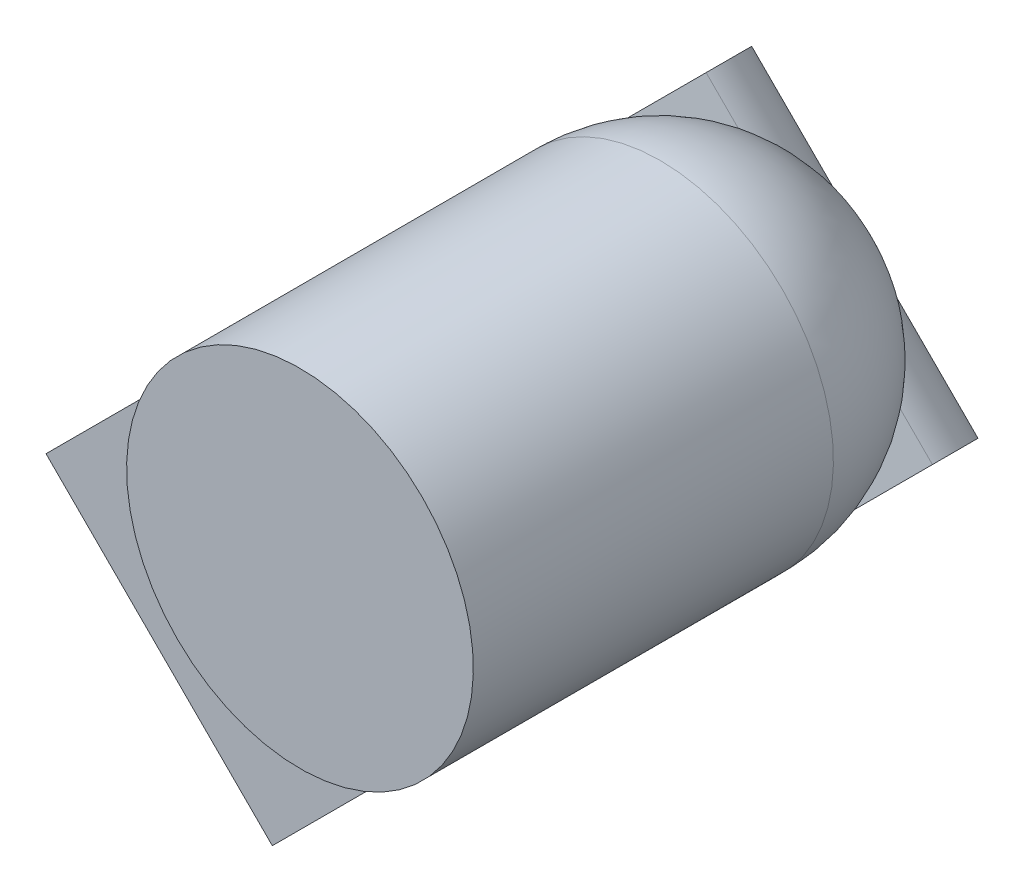
ISO-10303-21;
HEADER;
FILE_DESCRIPTION(('STEP AP214'),'2;1');
FILE_NAME('part.step','',(''),(''),'','','');
FILE_SCHEMA(('AUTOMOTIVE_DESIGN { 1 0 10303 214 1 1 1 1 }'));
ENDSEC;
DATA;
#1=APPLICATION_CONTEXT('core data for automotive mechanical design processes');
#2=APPLICATION_PROTOCOL_DEFINITION('international standard','automotive_design',2000,#1);
#3=PRODUCT_CONTEXT('',#1,'mechanical');
#4=PRODUCT('Part','Part','',(#3));
#5=PRODUCT_RELATED_PRODUCT_CATEGORY('part','',(#4));
#6=PRODUCT_DEFINITION_FORMATION('','',#4);
#7=PRODUCT_DEFINITION_CONTEXT('part definition',#1,'design');
#8=PRODUCT_DEFINITION('design','',#6,#7);
#9=PRODUCT_DEFINITION_SHAPE('','',#8);
#10=(LENGTH_UNIT() NAMED_UNIT(*) SI_UNIT(.MILLI.,.METRE.));
#11=(NAMED_UNIT(*) PLANE_ANGLE_UNIT() SI_UNIT($,.RADIAN.));
#12=(NAMED_UNIT(*) SI_UNIT($,.STERADIAN.) SOLID_ANGLE_UNIT());
#13=UNCERTAINTY_MEASURE_WITH_UNIT(LENGTH_MEASURE(1.E-05),#10,'distance_accuracy_value','');
#14=(GEOMETRIC_REPRESENTATION_CONTEXT(3) GLOBAL_UNCERTAINTY_ASSIGNED_CONTEXT((#13)) GLOBAL_UNIT_ASSIGNED_CONTEXT((#10,
#11,#12)) REPRESENTATION_CONTEXT('',''));
#15=CARTESIAN_POINT('',(0.,0.,0.));
#16=DIRECTION('',(0.,0.,1.));
#17=DIRECTION('',(1.,0.,0.));
#18=AXIS2_PLACEMENT_3D('',#15,#16,#17);
#19=CARTESIAN_POINT('',(-8.48634493812167,-11.9275672571191,4.380316059209));
#20=DIRECTION('',(3.09086344020721E-08,-3.09086344020721E-08,1.));
#21=DIRECTION('',(0.707106781186547,-0.707106781186547,-4.37114099658419E-08));
#22=AXIS2_PLACEMENT_3D('',#19,#20,#21);
#23=PLANE('',#22);
#24=CARTESIAN_POINT('',(-8.94596434589293,-12.3871866648904,4.380316059209));
#25=DIRECTION('',(-3.09086344020721E-08,3.09086344020721E-08,-1.));
#26=DIRECTION('',(0.707106781186548,0.707106781186548,0.));
#27=AXIS2_PLACEMENT_3D('',#24,#25,#26);
#28=CIRCLE('',#27,0.65);
#29=CARTESIAN_POINT('',(-8.48634493812167,-11.9275672571191,4.380316059209));
#30=VERTEX_POINT('',#29);
#31=EDGE_CURVE('E11',#30,#30,#28,.T.);
#32=ORIENTED_EDGE('',*,*,#31,.F.);
#33=EDGE_LOOP('',(#32));
#34=FACE_BOUND('',#33,.T.);
#35=ADVANCED_FACE('F17',(#34),#23,.T.);
#36=CARTESIAN_POINT('',(-8.94596436675627,-12.387186644027,3.705316059209));
#37=DIRECTION('',(-3.09086344020721E-08,3.09086344020721E-08,-1.));
#38=DIRECTION('',(0.707106781186548,0.707106781186548,0.));
#39=AXIS2_PLACEMENT_3D('',#36,#37,#38);
#40=CYLINDRICAL_SURFACE('',#39,0.65);
#41=DIRECTION('',(-3.09086344020721E-08,3.09086344020721E-08,-1.));
#42=VECTOR('',#41,1.);
#43=CARTESIAN_POINT('',(-8.69847699334096,-12.9882274080356,3.70531603298216));
#44=LINE('',#43,#42);
#45=CARTESIAN_POINT('',(-8.69847699813181,-12.9882274032448,3.55031603298215));
#46=VERTEX_POINT('',#45);
#47=CARTESIAN_POINT('',(-8.6984770142043,-12.9882273871723,3.03031603298215));
#48=VERTEX_POINT('',#47);
#49=EDGE_CURVE('E147',#46,#48,#44,.T.);
#50=ORIENTED_EDGE('',*,*,#49,.T.);
#51=CARTESIAN_POINT('',(-8.94596438761959,-12.3871866231637,3.030316059209));
#52=DIRECTION('',(-3.09086344020721E-08,3.09086344020721E-08,-1.));
#53=DIRECTION('',(0.707106781186548,0.707106781186548,0.));
#54=AXIS2_PLACEMENT_3D('',#51,#52,#53);
#55=CIRCLE('',#54,0.65);
#56=CARTESIAN_POINT('',(-9.54700515162815,-12.1396992497484,3.03031608543585));
#57=VERTEX_POINT('',#56);
#58=EDGE_CURVE('E26',#57,#48,#55,.T.);
#59=ORIENTED_EDGE('',*,*,#58,.F.);
#60=DIRECTION('',(3.09086344020721E-08,-3.09086344020721E-08,1.));
#61=VECTOR('',#60,1.);
#62=CARTESIAN_POINT('',(-9.54700513076483,-12.1396992706117,3.70531608543585));
#63=LINE('',#62,#61);
#64=CARTESIAN_POINT('',(-9.54700513555566,-12.1396992658209,3.55031608543585));
#65=VERTEX_POINT('',#64);
#66=EDGE_CURVE('E159',#57,#65,#63,.T.);
#67=ORIENTED_EDGE('',*,*,#66,.T.);
#68=CARTESIAN_POINT('',(-8.9459643715471,-12.3871866392362,3.550316059209));
#69=DIRECTION('',(3.09086344020721E-08,-3.09086344020721E-08,1.));
#70=DIRECTION('',(0.707106781186548,0.707106781186548,0.));
#71=AXIS2_PLACEMENT_3D('',#68,#69,#70);
#72=CIRCLE('',#71,0.65);
#73=CARTESIAN_POINT('',(-9.59183879315091,-12.3140687103935,3.55031608143207));
#74=VERTEX_POINT('',#73);
#75=EDGE_CURVE('E38',#65,#74,#72,.T.);
#76=ORIENTED_EDGE('',*,*,#75,.T.);
#77=DIRECTION('',(-3.09086344020721E-08,3.09086344020721E-08,-1.));
#78=VECTOR('',#77,1.);
#79=CARTESIAN_POINT('',(-9.59183878836008,-12.3140687151843,3.70531608143207));
#80=LINE('',#79,#78);
#81=CARTESIAN_POINT('',(-9.5918388092234,-12.314068694321,3.03031608143207));
#82=VERTEX_POINT('',#81);
#83=EDGE_CURVE('E165',#74,#82,#80,.T.);
#84=ORIENTED_EDGE('',*,*,#83,.T.);
#85=CARTESIAN_POINT('',(-8.87284645877687,-13.0330610447675,3.03031603698593));
#86=VERTEX_POINT('',#85);
#87=EDGE_CURVE('E186',#86,#82,#55,.T.);
#88=ORIENTED_EDGE('',*,*,#87,.F.);
#89=DIRECTION('',(3.09086344020721E-08,-3.09086344020721E-08,1.));
#90=VECTOR('',#89,1.);
#91=CARTESIAN_POINT('',(-8.87284643791354,-13.0330610656309,3.70531603698593));
#92=LINE('',#91,#90);
#93=CARTESIAN_POINT('',(-8.87284644270438,-13.03306106084,3.55031603698593));
#94=VERTEX_POINT('',#93);
#95=EDGE_CURVE('E209',#86,#94,#92,.T.);
#96=ORIENTED_EDGE('',*,*,#95,.T.);
#97=EDGE_CURVE('E214',#94,#46,#72,.T.);
#98=ORIENTED_EDGE('',*,*,#97,.T.);
#99=EDGE_LOOP('',(#50,#59,#67,#76,#84,#88,#96,#98));
#100=FACE_BOUND('',#99,.T.);
#101=ORIENTED_EDGE('',*,*,#31,.T.);
#102=EDGE_LOOP('',(#101));
#103=FACE_BOUND('',#102,.T.);
#104=ADVANCED_FACE('F274',(#100,#103),#40,.T.);
#105=CARTESIAN_POINT('',(-8.94596438761959,-12.3871866231637,3.030316059209));
#106=DIRECTION('',(3.09086343587743E-08,-3.09086343587743E-08,1.));
#107=DIRECTION('',(-0.707106781186547,0.707106781186547,4.37114099046096E-08));
#108=AXIS2_PLACEMENT_3D('',#105,#106,#107);
#109=SPHERICAL_SURFACE('',#108,0.65);
#110=ORIENTED_EDGE('',*,*,#58,.T.);
#111=CARTESIAN_POINT('',(-8.52170031890766,-12.8114506918756,3.03031603298215));
#112=DIRECTION('',(0.707106781186547,-0.707106781186547,-4.37114099658419E-08));
#113=DIRECTION('',(3.09086344020721E-08,-3.09086344020721E-08,1.));
#114=AXIS2_PLACEMENT_3D('',#111,#112,#113);
#115=CIRCLE('',#114,0.25);
#116=CARTESIAN_POINT('',(-8.57473333486788,-12.8644836930934,2.79183123262816));
#117=VERTEX_POINT('',#116);
#118=EDGE_CURVE('E229',#48,#117,#115,.T.);
#119=ORIENTED_EDGE('',*,*,#118,.T.);
#120=CARTESIAN_POINT('',(-8.99899739620858,-12.4402196317527,3.030316059209));
#121=DIRECTION('',(0.707106781186548,0.707106781186548,0.));
#122=DIRECTION('',(0.707106781186547,-0.707106781186547,-4.37114099658419E-08));
#123=AXIS2_PLACEMENT_3D('',#120,#121,#122);
#124=CIRCLE('',#123,0.645658578507);
#125=CARTESIAN_POINT('',(-9.42326147229175,-12.0159555556695,2.79183128508185));
#126=VERTEX_POINT('',#125);
#127=EDGE_CURVE('E235',#117,#126,#124,.T.);
#128=ORIENTED_EDGE('',*,*,#127,.T.);
#129=CARTESIAN_POINT('',(-9.37022845633151,-11.9629225544518,3.03031608543585));
#130=DIRECTION('',(-0.707106781186547,0.707106781186547,4.37114099658419E-08));
#131=DIRECTION('',(-3.09086344020721E-08,3.09086344020721E-08,-1.));
#132=AXIS2_PLACEMENT_3D('',#129,#130,#131);
#133=CIRCLE('',#132,0.25);
#134=EDGE_CURVE('E232',#126,#57,#133,.T.);
#135=ORIENTED_EDGE('',*,*,#134,.T.);
#136=EDGE_LOOP('',(#110,#119,#128,#135));
#137=FACE_BOUND('',#136,.T.);
#138=ADVANCED_FACE('F280',(#137),#109,.T.);
#139=CARTESIAN_POINT('',(-9.23234263400013,-12.6735648695443,3.030316059209));
#140=DIRECTION('',(-0.707106781186548,-0.707106781186548,0.));
#141=DIRECTION('',(-0.707106781186547,0.707106781186547,4.37114099658419E-08));
#142=AXIS2_PLACEMENT_3D('',#139,#140,#141);
#143=CIRCLE('',#142,0.508404366622);
#144=EDGE_CURVE('E223',#82,#86,#143,.T.);
#145=ORIENTED_EDGE('',*,*,#144,.T.);
#146=ORIENTED_EDGE('',*,*,#87,.T.);
#147=EDGE_LOOP('',(#145,#146));
#148=FACE_BOUND('',#147,.T.);
#149=ADVANCED_FACE('F277',(#148),#109,.T.);
#150=CARTESIAN_POINT('',(-11.473871160652,-14.9150933356152,2.05031605920901));
#151=DIRECTION('',(-3.09086344020721E-08,3.09086344020721E-08,-1.));
#152=DIRECTION('',(0.707106781186548,0.707106781186548,0.));
#153=AXIS2_PLACEMENT_3D('',#150,#151,#152);
#154=PLANE('',#153);
#155=DIRECTION('',(-0.707106781186547,0.707106781186547,4.37114099658419E-08));
#156=VECTOR('',#155,1.);
#157=CARTESIAN_POINT('',(-9.2323426642906,-12.6735648392538,2.05031605920901));
#158=LINE('',#157,#156);
#159=CARTESIAN_POINT('',(-8.80807859557867,-13.0978289079657,2.05031603298215));
#160=VERTEX_POINT('',#159);
#161=CARTESIAN_POINT('',(-9.65660673300253,-12.2493007705419,2.05031608543585));
#162=VERTEX_POINT('',#161);
#163=EDGE_CURVE('E198',#160,#162,#158,.T.);
#164=ORIENTED_EDGE('',*,*,#163,.F.);
#165=DIRECTION('',(0.707106781186548,0.707106781186548,0.));
#166=VECTOR('',#165,1.);
#167=CARTESIAN_POINT('',(-11.04960709194,-15.3393574043271,2.05031603298215));
#168=LINE('',#167,#166);
#169=CARTESIAN_POINT('',(-11.04960709194,-15.3393574043271,2.05031603298215));
#170=VERTEX_POINT('',#169);
#171=EDGE_CURVE('E173',#170,#160,#168,.T.);
#172=ORIENTED_EDGE('',*,*,#171,.F.);
#173=DIRECTION('',(-0.707106781186547,0.707106781186547,4.37114099658419E-08));
#174=VECTOR('',#173,1.);
#175=CARTESIAN_POINT('',(-11.473871160652,-14.9150933356152,2.05031605920901));
#176=LINE('',#175,#174);
#177=CARTESIAN_POINT('',(-11.8981352293639,-14.4908292669032,2.05031608543585));
#178=VERTEX_POINT('',#177);
#179=EDGE_CURVE('E187',#170,#178,#176,.T.);
#180=ORIENTED_EDGE('',*,*,#179,.T.);
#181=DIRECTION('',(-0.707106781186548,-0.707106781186548,0.));
#182=VECTOR('',#181,1.);
#183=CARTESIAN_POINT('',(-11.8981352293639,-14.4908292669032,2.05031608543585));
#184=LINE('',#183,#182);
#185=EDGE_CURVE('E181',#162,#178,#184,.T.);
#186=ORIENTED_EDGE('',*,*,#185,.F.);
#187=EDGE_LOOP('',(#164,#172,#180,#186));
#188=FACE_BOUND('',#187,.T.);
#189=ADVANCED_FACE('F279',(#188),#154,.T.);
#190=CARTESIAN_POINT('',(-9.23234265409076,-12.6735648494537,2.38031605920901));
#191=DIRECTION('',(3.0908633984165E-08,-3.09086348199792E-08,1.));
#192=DIRECTION('',(-0.707106781186548,-0.707106781186548,0.));
#193=AXIS2_PLACEMENT_3D('',#190,#191,#192);
#194=PLANE('',#193);
#195=DIRECTION('',(0.707106781186547,-0.707106781186547,-4.37114099658419E-08));
#196=VECTOR('',#195,1.);
#197=CARTESIAN_POINT('',(-11.4738711504521,-14.915093345815,2.38031605920901));
#198=LINE('',#197,#196);
#199=CARTESIAN_POINT('',(-11.898135219164,-14.4908292771031,2.38031608543585));
#200=VERTEX_POINT('',#199);
#201=CARTESIAN_POINT('',(-11.0496070817402,-15.339357414527,2.38031603298216));
#202=VERTEX_POINT('',#201);
#203=EDGE_CURVE('E131',#200,#202,#198,.T.);
#204=ORIENTED_EDGE('',*,*,#203,.T.);
#205=DIRECTION('',(-0.707106781186548,-0.707106781186548,0.));
#206=VECTOR('',#205,1.);
#207=CARTESIAN_POINT('',(-8.80807858537883,-13.0978289181656,2.38031603298216));
#208=LINE('',#207,#206);
#209=CARTESIAN_POINT('',(-8.80807858537883,-13.0978289181656,2.38031603298216));
#210=VERTEX_POINT('',#209);
#211=EDGE_CURVE('E129',#210,#202,#208,.T.);
#212=ORIENTED_EDGE('',*,*,#211,.F.);
#213=DIRECTION('',(0.707106781186547,-0.707106781186547,-4.37114099658419E-08));
#214=VECTOR('',#213,1.);
#215=CARTESIAN_POINT('',(-9.23234265409076,-12.6735648494537,2.38031605920901));
#216=LINE('',#215,#214);
#217=CARTESIAN_POINT('',(-9.65660672280268,-12.2493007807417,2.38031608543585));
#218=VERTEX_POINT('',#217);
#219=EDGE_CURVE('E112',#218,#210,#216,.T.);
#220=ORIENTED_EDGE('',*,*,#219,.F.);
#221=DIRECTION('',(0.707106781186548,0.707106781186548,0.));
#222=VECTOR('',#221,1.);
#223=CARTESIAN_POINT('',(-9.65660672280268,-12.2493007807417,2.38031608543585));
#224=LINE('',#223,#222);
#225=EDGE_CURVE('E180',#200,#218,#224,.T.);
#226=ORIENTED_EDGE('',*,*,#225,.F.);
#227=EDGE_LOOP('',(#204,#212,#220,#226));
#228=FACE_BOUND('',#227,.T.);
#229=ADVANCED_FACE('F130',(#228),#194,.T.);
#230=CARTESIAN_POINT('',(-11.4738711504521,-14.915093345815,2.38031605920901));
#231=DIRECTION('',(-0.707106781186548,-0.707106781186548,0.));
#232=DIRECTION('',(-3.09086344020721E-08,3.09086344020721E-08,-1.));
#233=AXIS2_PLACEMENT_3D('',#230,#231,#232);
#234=PLANE('',#233);
#235=ORIENTED_EDGE('',*,*,#179,.F.);
#236=DIRECTION('',(-3.09086344020721E-08,3.09086344020721E-08,-1.));
#237=VECTOR('',#236,1.);
#238=CARTESIAN_POINT('',(-11.0496070817402,-15.339357414527,2.38031603298216));
#239=LINE('',#238,#237);
#240=EDGE_CURVE('E136',#202,#170,#239,.T.);
#241=ORIENTED_EDGE('',*,*,#240,.F.);
#242=ORIENTED_EDGE('',*,*,#203,.F.);
#243=DIRECTION('',(3.09086344020721E-08,-3.09086344020721E-08,1.));
#244=VECTOR('',#243,1.);
#245=CARTESIAN_POINT('',(-11.898135219164,-14.4908292771031,2.38031608543585));
#246=LINE('',#245,#244);
#247=EDGE_CURVE('E176',#178,#200,#246,.T.);
#248=ORIENTED_EDGE('',*,*,#247,.F.);
#249=EDGE_LOOP('',(#235,#241,#242,#248));
#250=FACE_BOUND('',#249,.T.);
#251=ADVANCED_FACE('F328',(#250),#234,.T.);
#252=CARTESIAN_POINT('',(-8.99899738013608,-12.4402196478252,3.550316059209));
#253=DIRECTION('',(3.09086344020721E-08,-3.09086344020721E-08,1.));
#254=DIRECTION('',(-0.707106781186548,-0.707106781186548,0.));
#255=AXIS2_PLACEMENT_3D('',#252,#253,#254);
#256=PLANE('',#255);
#257=ORIENTED_EDGE('',*,*,#97,.F.);
#258=DIRECTION('',(0.707106781186547,-0.707106781186547,-4.37114099658419E-08));
#259=VECTOR('',#258,1.);
#260=CARTESIAN_POINT('',(-9.23234261792764,-12.6735648856168,3.550316059209));
#261=LINE('',#260,#259);
#262=CARTESIAN_POINT('',(-8.80807854921573,-13.0978289543287,3.55031603298215));
#263=VERTEX_POINT('',#262);
#264=EDGE_CURVE('E126',#94,#263,#261,.T.);
#265=ORIENTED_EDGE('',*,*,#264,.T.);
#266=DIRECTION('',(-0.707106781186548,-0.707106781186548,0.));
#267=VECTOR('',#266,1.);
#268=CARTESIAN_POINT('',(-8.57473331142417,-12.8644837165371,3.55031603298215));
#269=LINE('',#268,#267);
#270=EDGE_CURVE('E142',#46,#263,#269,.T.);
#271=ORIENTED_EDGE('',*,*,#270,.F.);
#272=EDGE_LOOP('',(#257,#265,#271));
#273=FACE_BOUND('',#272,.T.);
#274=ADVANCED_FACE('F338',(#273),#256,.T.);
#275=ORIENTED_EDGE('',*,*,#75,.F.);
#276=DIRECTION('',(0.707106781186548,0.707106781186548,0.));
#277=VECTOR('',#276,1.);
#278=CARTESIAN_POINT('',(-9.42326144884802,-12.0159555791133,3.55031608543585));
#279=LINE('',#278,#277);
#280=CARTESIAN_POINT('',(-9.65660668663958,-12.2493008169048,3.55031608543585));
#281=VERTEX_POINT('',#280);
#282=EDGE_CURVE('E155',#281,#65,#279,.T.);
#283=ORIENTED_EDGE('',*,*,#282,.F.);
#284=EDGE_CURVE('E101',#281,#74,#261,.T.);
#285=ORIENTED_EDGE('',*,*,#284,.T.);
#286=EDGE_LOOP('',(#275,#283,#285));
#287=FACE_BOUND('',#286,.T.);
#288=ADVANCED_FACE('F349',(#287),#256,.T.);
#289=CARTESIAN_POINT('',(-9.23234261792764,-12.6735648856168,3.550316059209));
#290=DIRECTION('',(-0.707106781186548,-0.707106781186548,0.));
#291=DIRECTION('',(-3.0908634024646E-08,3.09086347794981E-08,-1.));
#292=AXIS2_PLACEMENT_3D('',#289,#290,#291);
#293=PLANE('',#292);
#294=ORIENTED_EDGE('',*,*,#95,.F.);
#295=ORIENTED_EDGE('',*,*,#144,.F.);
#296=ORIENTED_EDGE('',*,*,#83,.F.);
#297=ORIENTED_EDGE('',*,*,#284,.F.);
#298=DIRECTION('',(3.0908634024646E-08,-3.09086347794981E-08,1.));
#299=VECTOR('',#298,1.);
#300=CARTESIAN_POINT('',(-9.65660668663958,-12.2493008169048,3.55031608543585));
#301=LINE('',#300,#299);
#302=EDGE_CURVE('E121',#218,#281,#301,.T.);
#303=ORIENTED_EDGE('',*,*,#302,.F.);
#304=ORIENTED_EDGE('',*,*,#219,.T.);
#305=DIRECTION('',(-3.0908634024646E-08,3.09086347794981E-08,-1.));
#306=VECTOR('',#305,1.);
#307=CARTESIAN_POINT('',(-8.80807854921573,-13.0978289543287,3.55031603298215));
#308=LINE('',#307,#306);
#309=EDGE_CURVE('E118',#263,#210,#308,.T.);
#310=ORIENTED_EDGE('',*,*,#309,.F.);
#311=ORIENTED_EDGE('',*,*,#264,.F.);
#312=EDGE_LOOP('',(#294,#295,#296,#297,#303,#304,#310,#311));
#313=FACE_BOUND('',#312,.T.);
#314=ADVANCED_FACE('F115',(#313),#293,.T.);
#315=CARTESIAN_POINT('',(-9.54991137907152,-13.8396617148941,2.42942603298216));
#316=DIRECTION('',(0.707106781186547,-0.707106781186547,-4.37114099658419E-08));
#317=DIRECTION('',(0.707106781186548,0.707106781186548,0.));
#318=AXIS2_PLACEMENT_3D('',#315,#316,#317);
#319=PLANE('',#318);
#320=CARTESIAN_POINT('',(-8.80807858537883,-13.0978289181656,2.38031603298216));
#321=DIRECTION('',(-0.707106781186547,0.707106781186547,4.37114099658419E-08));
#322=DIRECTION('',(0.499999978144295,0.500000021855705,-0.707106781186548));
#323=AXIS2_PLACEMENT_3D('',#320,#321,#322);
#324=CIRCLE('',#323,0.33);
#325=CARTESIAN_POINT('',(-8.57473334758727,-12.864483680374,2.38031603298216));
#326=VERTEX_POINT('',#325);
#327=EDGE_CURVE('E203',#326,#160,#324,.T.);
#328=ORIENTED_EDGE('',*,*,#327,.F.);
#329=DIRECTION('',(3.090863414039E-08,-3.09086346637542E-08,1.));
#330=VECTOR('',#329,1.);
#331=CARTESIAN_POINT('',(-8.57473335778711,-12.8644836701742,2.05031603298215));
#332=LINE('',#331,#330);
#333=EDGE_CURVE('E220',#326,#117,#332,.T.);
#334=ORIENTED_EDGE('',*,*,#333,.T.);
#335=ORIENTED_EDGE('',*,*,#118,.F.);
#336=ORIENTED_EDGE('',*,*,#49,.F.);
#337=ORIENTED_EDGE('',*,*,#270,.T.);
#338=ORIENTED_EDGE('',*,*,#309,.T.);
#339=ORIENTED_EDGE('',*,*,#211,.T.);
#340=ORIENTED_EDGE('',*,*,#240,.T.);
#341=ORIENTED_EDGE('',*,*,#171,.T.);
#342=EDGE_LOOP('',(#328,#334,#335,#336,#337,#338,#339,#340,#341));
#343=FACE_BOUND('',#342,.T.);
#344=ADVANCED_FACE('F139',(#343),#319,.T.);
#345=CARTESIAN_POINT('',(-10.3984395164954,-12.9911335774703,2.42942608543585));
#346=DIRECTION('',(-0.707106781186547,0.707106781186547,4.37114099658419E-08));
#347=DIRECTION('',(-0.707106781186548,-0.707106781186548,0.));
#348=AXIS2_PLACEMENT_3D('',#345,#346,#347);
#349=PLANE('',#348);
#350=CARTESIAN_POINT('',(-9.65660672280268,-12.2493007807417,2.38031608543585));
#351=DIRECTION('',(0.707106781186547,-0.707106781186547,-4.37114099658419E-08));
#352=DIRECTION('',(0.499999978144295,0.500000021855705,-0.707106781186548));
#353=AXIS2_PLACEMENT_3D('',#350,#351,#352);
#354=CIRCLE('',#353,0.33);
#355=CARTESIAN_POINT('',(-9.42326148501112,-12.0159555429502,2.38031608543585));
#356=VERTEX_POINT('',#355);
#357=EDGE_CURVE('E202',#162,#356,#354,.T.);
#358=ORIENTED_EDGE('',*,*,#357,.F.);
#359=ORIENTED_EDGE('',*,*,#185,.T.);
#360=ORIENTED_EDGE('',*,*,#247,.T.);
#361=ORIENTED_EDGE('',*,*,#225,.T.);
#362=ORIENTED_EDGE('',*,*,#302,.T.);
#363=ORIENTED_EDGE('',*,*,#282,.T.);
#364=ORIENTED_EDGE('',*,*,#66,.F.);
#365=ORIENTED_EDGE('',*,*,#134,.F.);
#366=DIRECTION('',(-3.090863414039E-08,3.09086346637542E-08,-1.));
#367=VECTOR('',#366,1.);
#368=CARTESIAN_POINT('',(-9.42326149521097,-12.0159555327503,2.05031608543585));
#369=LINE('',#368,#367);
#370=EDGE_CURVE('E239',#126,#356,#369,.T.);
#371=ORIENTED_EDGE('',*,*,#370,.T.);
#372=EDGE_LOOP('',(#358,#359,#360,#361,#362,#363,#364,#365,#371));
#373=FACE_BOUND('',#372,.T.);
#374=ADVANCED_FACE('F377',(#373),#349,.T.);
#375=CARTESIAN_POINT('',(-8.99899742649904,-12.4402196014622,2.05031605920901));
#376=DIRECTION('',(0.707106781186548,0.707106781186548,0.));
#377=DIRECTION('',(3.090863414039E-08,-3.09086346637542E-08,1.));
#378=AXIS2_PLACEMENT_3D('',#375,#376,#377);
#379=PLANE('',#378);
#380=DIRECTION('',(0.707106781186547,-0.707106781186547,-4.37114099658419E-08));
#381=VECTOR('',#380,1.);
#382=CARTESIAN_POINT('',(-8.99899741629918,-12.4402196116621,2.38031605920901));
#383=LINE('',#382,#381);
#384=EDGE_CURVE('E495',#356,#326,#383,.T.);
#385=ORIENTED_EDGE('',*,*,#384,.F.);
#386=ORIENTED_EDGE('',*,*,#370,.F.);
#387=ORIENTED_EDGE('',*,*,#127,.F.);
#388=ORIENTED_EDGE('',*,*,#333,.F.);
#389=EDGE_LOOP('',(#385,#386,#387,#388));
#390=FACE_BOUND('',#389,.T.);
#391=ADVANCED_FACE('F387',(#390),#379,.T.);
#392=CARTESIAN_POINT('',(-9.23234265409076,-12.6735648494537,2.38031605920901));
#393=DIRECTION('',(0.707106781186547,-0.707106781186547,-4.37114099658419E-08));
#394=DIRECTION('',(0.499999978144295,0.500000021855705,-0.707106781186548));
#395=AXIS2_PLACEMENT_3D('',#392,#393,#394);
#396=CYLINDRICAL_SURFACE('',#395,0.33);
#397=ORIENTED_EDGE('',*,*,#327,.T.);
#398=ORIENTED_EDGE('',*,*,#163,.T.);
#399=ORIENTED_EDGE('',*,*,#357,.T.);
#400=ORIENTED_EDGE('',*,*,#384,.T.);
#401=EDGE_LOOP('',(#397,#398,#399,#400));
#402=FACE_BOUND('',#401,.T.);
#403=ADVANCED_FACE('F398',(#402),#396,.T.);
#404=CLOSED_SHELL('',(#35,#104,#138,#149,#189,#229,#251,#274,#288,#314,#344,#374,#391,#403));
#405=MANIFOLD_SOLID_BREP('B1',#404);
#406=ADVANCED_BREP_SHAPE_REPRESENTATION('',(#18,#405),#14);
#407=SHAPE_DEFINITION_REPRESENTATION(#9,#406);
ENDSEC;
END-ISO-10303-21;
